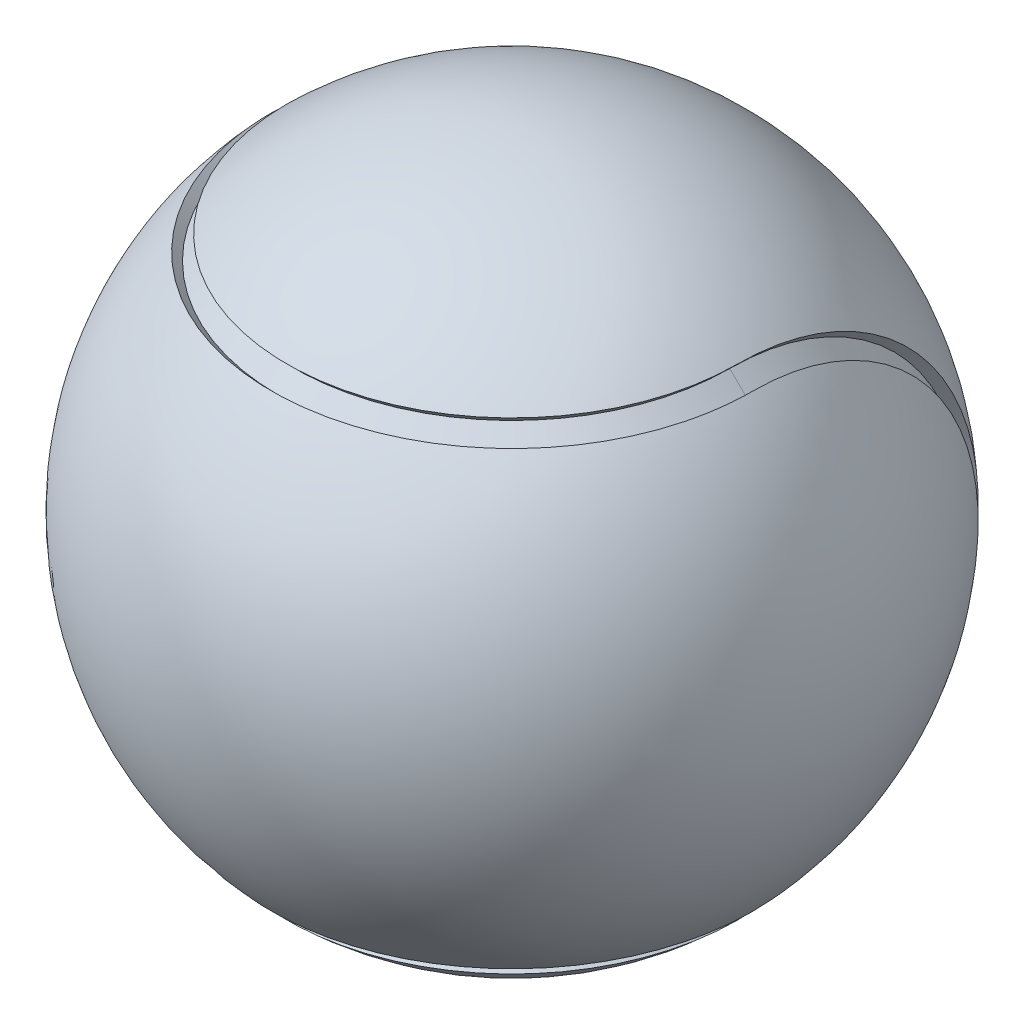
ISO-10303-21;
HEADER;
FILE_DESCRIPTION(('STEP AP214'),'2;1');
FILE_NAME('part.step','',(''),(''),'','','');
FILE_SCHEMA(('AUTOMOTIVE_DESIGN { 1 0 10303 214 1 1 1 1 }'));
ENDSEC;
DATA;
#1=APPLICATION_CONTEXT('core data for automotive mechanical design processes');
#2=APPLICATION_PROTOCOL_DEFINITION('international standard','automotive_design',2000,#1);
#3=PRODUCT_CONTEXT('',#1,'mechanical');
#4=PRODUCT('Part','Part','',(#3));
#5=PRODUCT_RELATED_PRODUCT_CATEGORY('part','',(#4));
#6=PRODUCT_DEFINITION_FORMATION('','',#4);
#7=PRODUCT_DEFINITION_CONTEXT('part definition',#1,'design');
#8=PRODUCT_DEFINITION('design','',#6,#7);
#9=PRODUCT_DEFINITION_SHAPE('','',#8);
#10=(LENGTH_UNIT() NAMED_UNIT(*) SI_UNIT(.MILLI.,.METRE.));
#11=(NAMED_UNIT(*) PLANE_ANGLE_UNIT() SI_UNIT($,.RADIAN.));
#12=(NAMED_UNIT(*) SI_UNIT($,.STERADIAN.) SOLID_ANGLE_UNIT());
#13=UNCERTAINTY_MEASURE_WITH_UNIT(LENGTH_MEASURE(1.E-05),#10,'distance_accuracy_value','');
#14=(GEOMETRIC_REPRESENTATION_CONTEXT(3) GLOBAL_UNCERTAINTY_ASSIGNED_CONTEXT((#13)) GLOBAL_UNIT_ASSIGNED_CONTEXT((#10,
#11,#12)) REPRESENTATION_CONTEXT('',''));
#15=CARTESIAN_POINT('',(0.,0.,0.));
#16=DIRECTION('',(0.,0.,1.));
#17=DIRECTION('',(1.,0.,0.));
#18=AXIS2_PLACEMENT_3D('',#15,#16,#17);
#19=CARTESIAN_POINT('',(0.,0.,0.));
#20=DIRECTION('',(-1.,0.,0.));
#21=DIRECTION('',(0.,1.,0.));
#22=AXIS2_PLACEMENT_3D('',#19,#20,#21);
#23=SPHERICAL_SURFACE('',#22,38.1);
#24=CARTESIAN_POINT('',(0.,26.0277714977281,0.));
#25=DIRECTION('',(0.,-1.,0.));
#26=DIRECTION('',(1.,0.,0.));
#27=AXIS2_PLACEMENT_3D('',#24,#25,#26);
#28=CIRCLE('',#27,27.8238227219419);
#29=CARTESIAN_POINT('',(-27.8238227219419,26.0277714977281,0.));
#30=VERTEX_POINT('',#29);
#31=CARTESIAN_POINT('',(27.8238227219419,26.0277714977281,-3.91992866779406E-13));
#32=VERTEX_POINT('',#31);
#33=EDGE_CURVE('E195',#30,#32,#28,.F.);
#34=ORIENTED_EDGE('',*,*,#33,.F.);
#35=CARTESIAN_POINT('',(-27.8238227219419,0.,0.));
#36=DIRECTION('',(1.,0.,0.));
#37=DIRECTION('',(0.,0.,-1.));
#38=AXIS2_PLACEMENT_3D('',#35,#36,#37);
#39=CIRCLE('',#38,26.0277714977282);
#40=CARTESIAN_POINT('',(-27.8238227219419,-26.0277714977283,-1.15067513016814E-12));
#41=VERTEX_POINT('',#40);
#42=EDGE_CURVE('E11',#30,#41,#39,.F.);
#43=ORIENTED_EDGE('',*,*,#42,.T.);
#44=CARTESIAN_POINT('',(0.,-26.0277714977283,0.));
#45=DIRECTION('',(0.,1.,0.));
#46=DIRECTION('',(-1.,0.,0.));
#47=AXIS2_PLACEMENT_3D('',#44,#45,#46);
#48=CIRCLE('',#47,27.8238227219419);
#49=CARTESIAN_POINT('',(27.8238227219419,-26.0277714977283,7.58682263388733E-13));
#50=VERTEX_POINT('',#49);
#51=EDGE_CURVE('E42',#41,#50,#48,.T.);
#52=ORIENTED_EDGE('',*,*,#51,.T.);
#53=CARTESIAN_POINT('',(27.8238227219419,0.,0.));
#54=DIRECTION('',(-1.,0.,0.));
#55=DIRECTION('',(0.,0.,1.));
#56=AXIS2_PLACEMENT_3D('',#53,#54,#55);
#57=CIRCLE('',#56,26.0277714977282);
#58=EDGE_CURVE('E203',#50,#32,#57,.F.);
#59=ORIENTED_EDGE('',*,*,#58,.T.);
#60=EDGE_LOOP('',(#34,#43,#52,#59));
#61=FACE_BOUND('',#60,.T.);
#62=ADVANCED_FACE('F33',(#61),#23,.T.);
#63=CARTESIAN_POINT('',(-25.1447171389936,0.,0.));
#64=DIRECTION('',(-1.,0.,0.));
#65=DIRECTION('',(0.,0.,1.));
#66=AXIS2_PLACEMENT_3D('',#63,#64,#65);
#67=CONICAL_SURFACE('',#66,26.9407683632076,0.785398163397447);
#68=DIRECTION('',(-0.707106781186548,-0.707106781186547,0.));
#69=VECTOR('',#68,1.);
#70=CARTESIAN_POINT('',(-26.9407683632074,-28.7368195874215,-1.16395962782366E-12));
#71=LINE('',#70,#69);
#72=CARTESIAN_POINT('',(-25.1447171389936,-26.9407683632077,-1.08804921731343E-12));
#73=VERTEX_POINT('',#72);
#74=CARTESIAN_POINT('',(-26.027771497728,-27.8238227219421,-1.12537165999806E-12));
#75=VERTEX_POINT('',#74);
#76=EDGE_CURVE('E139',#73,#75,#71,.T.);
#77=ORIENTED_EDGE('',*,*,#76,.F.);
#78=CARTESIAN_POINT('',(-25.1447171389936,0.,0.));
#79=DIRECTION('',(1.,0.,0.));
#80=DIRECTION('',(0.,0.,-1.));
#81=AXIS2_PLACEMENT_3D('',#78,#79,#80);
#82=CIRCLE('',#81,26.9407683632076);
#83=CARTESIAN_POINT('',(-25.1447171389936,26.9407683632075,0.));
#84=VERTEX_POINT('',#83);
#85=EDGE_CURVE('E119',#73,#84,#82,.T.);
#86=ORIENTED_EDGE('',*,*,#85,.T.);
#87=CARTESIAN_POINT('',(-25.1447171389936,26.9407683632075,1.08440110672005E-12));
#88=DIRECTION('',(-0.707106781186548,0.707106781186548,0.));
#89=VECTOR('',#88,1.);
#90=LINE('',#87,#89);
#91=CARTESIAN_POINT('',(-26.027771497728,27.8238227219419,5.56785116184242E-13));
#92=VERTEX_POINT('',#91);
#93=EDGE_CURVE('E123',#84,#92,#90,.T.);
#94=ORIENTED_EDGE('',*,*,#93,.T.);
#95=CARTESIAN_POINT('',(-26.027771497728,0.,0.));
#96=DIRECTION('',(1.,0.,0.));
#97=DIRECTION('',(0.,0.,-1.));
#98=AXIS2_PLACEMENT_3D('',#95,#96,#97);
#99=CIRCLE('',#98,27.823822721942);
#100=EDGE_CURVE('E189',#75,#92,#99,.T.);
#101=ORIENTED_EDGE('',*,*,#100,.F.);
#102=EDGE_LOOP('',(#77,#86,#94,#101));
#103=FACE_BOUND('',#102,.T.);
#104=ADVANCED_FACE('F137',(#103),#67,.F.);
#105=CARTESIAN_POINT('',(-28.7368195874213,0.,0.));
#106=DIRECTION('',(-1.,0.,0.));
#107=DIRECTION('',(0.,0.,1.));
#108=AXIS2_PLACEMENT_3D('',#105,#106,#107);
#109=CONICAL_SURFACE('',#108,26.9407683632076,0.78539816339745);
#110=CARTESIAN_POINT('',(-27.8238227219419,26.0277714977281,1.14590033673251E-12));
#111=DIRECTION('',(0.707106781186548,-0.707106781186548,0.));
#112=VECTOR('',#111,1.);
#113=LINE('',#110,#112);
#114=CARTESIAN_POINT('',(-26.9407683632074,25.1447171389936,1.11027334774753E-12));
#115=VERTEX_POINT('',#114);
#116=EDGE_CURVE('E49',#30,#115,#113,.T.);
#117=ORIENTED_EDGE('',*,*,#116,.T.);
#118=CARTESIAN_POINT('',(-26.9407683632074,0.,0.));
#119=DIRECTION('',(1.,0.,0.));
#120=DIRECTION('',(0.,0.,-1.));
#121=AXIS2_PLACEMENT_3D('',#118,#119,#120);
#122=CIRCLE('',#121,25.1447171389937);
#123=CARTESIAN_POINT('',(-26.9407683632074,-25.1447171389938,-1.1133526874835E-12));
#124=VERTEX_POINT('',#123);
#125=EDGE_CURVE('E122',#124,#115,#122,.T.);
#126=ORIENTED_EDGE('',*,*,#125,.F.);
#127=DIRECTION('',(0.707106781186546,0.707106781186549,0.));
#128=VECTOR('',#127,1.);
#129=CARTESIAN_POINT('',(-28.7368195874213,-26.9407683632077,-1.18926309799374E-12));
#130=LINE('',#129,#128);
#131=EDGE_CURVE('E214',#41,#124,#130,.T.);
#132=ORIENTED_EDGE('',*,*,#131,.F.);
#133=ORIENTED_EDGE('',*,*,#42,.F.);
#134=EDGE_LOOP('',(#117,#126,#132,#133));
#135=FACE_BOUND('',#134,.T.);
#136=ADVANCED_FACE('F161',(#135),#109,.T.);
#137=CARTESIAN_POINT('',(0.,-26.9407683632077,0.));
#138=DIRECTION('',(0.,-1.,0.));
#139=DIRECTION('',(1.,0.,0.));
#140=AXIS2_PLACEMENT_3D('',#137,#138,#139);
#141=CONICAL_SURFACE('',#140,25.1447171389936,0.785398163397449);
#142=DIRECTION('',(0.707106781186548,-0.707106781186547,0.));
#143=VECTOR('',#142,1.);
#144=CARTESIAN_POINT('',(26.9407683632074,-28.7368195874215,7.8440757527247E-13));
#145=LINE('',#144,#143);
#146=CARTESIAN_POINT('',(25.1447171389936,-26.9407683632076,7.33800634932311E-13));
#147=VERTEX_POINT('',#146);
#148=CARTESIAN_POINT('',(26.027771497728,-27.8238227219421,7.58682263388733E-13));
#149=VERTEX_POINT('',#148);
#150=EDGE_CURVE('E285',#147,#149,#145,.T.);
#151=ORIENTED_EDGE('',*,*,#150,.F.);
#152=CARTESIAN_POINT('',(0.,-26.9407683632077,0.));
#153=DIRECTION('',(0.,-1.,0.));
#154=DIRECTION('',(1.,0.,0.));
#155=AXIS2_PLACEMENT_3D('',#152,#153,#154);
#156=CIRCLE('',#155,25.1447171389936);
#157=EDGE_CURVE('E226',#147,#73,#156,.T.);
#158=ORIENTED_EDGE('',*,*,#157,.T.);
#159=ORIENTED_EDGE('',*,*,#76,.T.);
#160=CARTESIAN_POINT('',(0.,-27.8238227219421,0.));
#161=DIRECTION('',(0.,1.,0.));
#162=DIRECTION('',(-1.,0.,0.));
#163=AXIS2_PLACEMENT_3D('',#160,#161,#162);
#164=CIRCLE('',#163,26.027771497728);
#165=EDGE_CURVE('E188',#149,#75,#164,.F.);
#166=ORIENTED_EDGE('',*,*,#165,.F.);
#167=EDGE_LOOP('',(#151,#158,#159,#166));
#168=FACE_BOUND('',#167,.T.);
#169=ADVANCED_FACE('F280',(#168),#141,.T.);
#170=CARTESIAN_POINT('',(0.,-26.9407683632077,0.));
#171=DIRECTION('',(0.,-1.,0.));
#172=DIRECTION('',(1.,0.,0.));
#173=AXIS2_PLACEMENT_3D('',#170,#171,#172);
#174=CONICAL_SURFACE('',#173,28.7368195874213,0.785398163397446);
#175=ORIENTED_EDGE('',*,*,#131,.T.);
#176=CARTESIAN_POINT('',(0.,-25.1447171389938,0.));
#177=DIRECTION('',(0.,-1.,0.));
#178=DIRECTION('',(1.,0.,0.));
#179=AXIS2_PLACEMENT_3D('',#176,#177,#178);
#180=CIRCLE('',#179,26.9407683632074);
#181=CARTESIAN_POINT('',(26.9407683632075,-25.1447171389938,7.33800634932311E-13));
#182=VERTEX_POINT('',#181);
#183=EDGE_CURVE('E228',#182,#124,#180,.T.);
#184=ORIENTED_EDGE('',*,*,#183,.F.);
#185=DIRECTION('',(-0.707106781186546,0.707106781186549,0.));
#186=VECTOR('',#185,1.);
#187=CARTESIAN_POINT('',(28.7368195874213,-26.9407683632076,7.8440757527247E-13));
#188=LINE('',#187,#186);
#189=EDGE_CURVE('E111',#50,#182,#188,.T.);
#190=ORIENTED_EDGE('',*,*,#189,.F.);
#191=ORIENTED_EDGE('',*,*,#51,.F.);
#192=EDGE_LOOP('',(#175,#184,#190,#191));
#193=FACE_BOUND('',#192,.T.);
#194=ADVANCED_FACE('F212',(#193),#174,.F.);
#195=CARTESIAN_POINT('',(25.1447171389936,0.,0.));
#196=DIRECTION('',(1.,0.,0.));
#197=DIRECTION('',(0.,0.,-1.));
#198=AXIS2_PLACEMENT_3D('',#195,#196,#197);
#199=CONICAL_SURFACE('',#198,26.9407683632076,0.785398163397447);
#200=DIRECTION('',(0.707106781186548,0.707106781186547,0.));
#201=VECTOR('',#200,1.);
#202=CARTESIAN_POINT('',(26.9407683632074,28.7368195874213,-3.79552052551194E-13));
#203=LINE('',#202,#201);
#204=CARTESIAN_POINT('',(25.1447171389936,26.9407683632075,-3.54248582381115E-13));
#205=VERTEX_POINT('',#204);
#206=CARTESIAN_POINT('',(26.0277714977281,27.8238227219419,-3.66689396609326E-13));
#207=VERTEX_POINT('',#206);
#208=EDGE_CURVE('E58',#205,#207,#203,.T.);
#209=ORIENTED_EDGE('',*,*,#208,.F.);
#210=CARTESIAN_POINT('',(25.1447171389936,0.,0.));
#211=DIRECTION('',(-1.,0.,0.));
#212=DIRECTION('',(0.,0.,1.));
#213=AXIS2_PLACEMENT_3D('',#210,#211,#212);
#214=CIRCLE('',#213,26.9407683632076);
#215=EDGE_CURVE('E221',#205,#147,#214,.T.);
#216=ORIENTED_EDGE('',*,*,#215,.T.);
#217=ORIENTED_EDGE('',*,*,#150,.T.);
#218=CARTESIAN_POINT('',(26.027771497728,0.,0.));
#219=DIRECTION('',(-1.,0.,0.));
#220=DIRECTION('',(0.,0.,1.));
#221=AXIS2_PLACEMENT_3D('',#218,#219,#220);
#222=CIRCLE('',#221,27.823822721942);
#223=EDGE_CURVE('E190',#207,#149,#222,.T.);
#224=ORIENTED_EDGE('',*,*,#223,.F.);
#225=EDGE_LOOP('',(#209,#216,#217,#224));
#226=FACE_BOUND('',#225,.T.);
#227=ADVANCED_FACE('F270',(#226),#199,.F.);
#228=CARTESIAN_POINT('',(28.7368195874213,0.,0.));
#229=DIRECTION('',(1.,0.,0.));
#230=DIRECTION('',(0.,0.,-1.));
#231=AXIS2_PLACEMENT_3D('',#228,#229,#230);
#232=CONICAL_SURFACE('',#231,26.9407683632076,0.78539816339745);
#233=ORIENTED_EDGE('',*,*,#189,.T.);
#234=CARTESIAN_POINT('',(26.9407683632075,0.,0.));
#235=DIRECTION('',(-1.,0.,0.));
#236=DIRECTION('',(0.,0.,1.));
#237=AXIS2_PLACEMENT_3D('',#234,#235,#236);
#238=CIRCLE('',#237,25.1447171389937);
#239=CARTESIAN_POINT('',(26.9407683632075,25.1447171389936,-3.79552052551194E-13));
#240=VERTEX_POINT('',#239);
#241=EDGE_CURVE('E216',#240,#182,#238,.T.);
#242=ORIENTED_EDGE('',*,*,#241,.F.);
#243=DIRECTION('',(-0.707106781186546,-0.707106781186549,0.));
#244=VECTOR('',#243,1.);
#245=CARTESIAN_POINT('',(28.7368195874213,26.9407683632075,-4.04855522721274E-13));
#246=LINE('',#245,#244);
#247=EDGE_CURVE('E295',#32,#240,#246,.T.);
#248=ORIENTED_EDGE('',*,*,#247,.F.);
#249=ORIENTED_EDGE('',*,*,#58,.F.);
#250=EDGE_LOOP('',(#233,#242,#248,#249));
#251=FACE_BOUND('',#250,.T.);
#252=ADVANCED_FACE('F256',(#251),#232,.T.);
#253=CARTESIAN_POINT('',(0.,26.9407683632075,0.));
#254=DIRECTION('',(0.,1.,0.));
#255=DIRECTION('',(-1.,0.,0.));
#256=AXIS2_PLACEMENT_3D('',#253,#254,#255);
#257=CONICAL_SURFACE('',#256,28.7368195874213,0.785398163397446);
#258=ORIENTED_EDGE('',*,*,#33,.T.);
#259=ORIENTED_EDGE('',*,*,#247,.T.);
#260=CARTESIAN_POINT('',(0.,25.1447171389936,0.));
#261=DIRECTION('',(0.,-1.,0.));
#262=DIRECTION('',(1.,0.,0.));
#263=AXIS2_PLACEMENT_3D('',#260,#261,#262);
#264=CIRCLE('',#263,26.9407683632075);
#265=EDGE_CURVE('E112',#240,#115,#264,.T.);
#266=ORIENTED_EDGE('',*,*,#265,.T.);
#267=ORIENTED_EDGE('',*,*,#116,.F.);
#268=EDGE_LOOP('',(#258,#259,#266,#267));
#269=FACE_BOUND('',#268,.T.);
#270=ADVANCED_FACE('F173',(#269),#257,.F.);
#271=CARTESIAN_POINT('',(0.,26.9407683632075,0.));
#272=DIRECTION('',(0.,1.,0.));
#273=DIRECTION('',(-1.,0.,0.));
#274=AXIS2_PLACEMENT_3D('',#271,#272,#273);
#275=CONICAL_SURFACE('',#274,25.1447171389936,0.785398163397449);
#276=CARTESIAN_POINT('',(0.,27.8238227219419,0.));
#277=DIRECTION('',(0.,-1.,0.));
#278=DIRECTION('',(1.,0.,0.));
#279=AXIS2_PLACEMENT_3D('',#276,#277,#278);
#280=CIRCLE('',#279,26.0277714977281);
#281=EDGE_CURVE('E130',#207,#92,#280,.T.);
#282=ORIENTED_EDGE('',*,*,#281,.T.);
#283=ORIENTED_EDGE('',*,*,#93,.F.);
#284=CARTESIAN_POINT('',(0.,26.9407683632075,0.));
#285=DIRECTION('',(0.,-1.,0.));
#286=DIRECTION('',(1.,0.,0.));
#287=AXIS2_PLACEMENT_3D('',#284,#285,#286);
#288=CIRCLE('',#287,25.1447171389936);
#289=EDGE_CURVE('E101',#205,#84,#288,.T.);
#290=ORIENTED_EDGE('',*,*,#289,.F.);
#291=ORIENTED_EDGE('',*,*,#208,.T.);
#292=EDGE_LOOP('',(#282,#283,#290,#291));
#293=FACE_BOUND('',#292,.T.);
#294=ADVANCED_FACE('F128',(#293),#275,.T.);
#295=CARTESIAN_POINT('',(-26.9407683632074,0.,0.));
#296=DIRECTION('',(1.,0.,0.));
#297=DIRECTION('',(0.,0.,-1.));
#298=AXIS2_PLACEMENT_3D('',#295,#296,#297);
#299=CONICAL_SURFACE('',#298,25.1447171389937,0.785398163397447);
#300=DIRECTION('',(0.707106781186549,-0.707106781186546,0.));
#301=VECTOR('',#300,1.);
#302=CARTESIAN_POINT('',(-25.1447171389936,-26.9407683632077,-1.08804921731343E-12));
#303=LINE('',#302,#301);
#304=EDGE_CURVE('E218',#124,#73,#303,.T.);
#305=ORIENTED_EDGE('',*,*,#304,.F.);
#306=ORIENTED_EDGE('',*,*,#125,.T.);
#307=CARTESIAN_POINT('',(-26.9407683632074,25.1447171389936,1.05927759891712E-12));
#308=DIRECTION('',(0.707106781186548,0.707106781186547,0.));
#309=VECTOR('',#308,1.);
#310=LINE('',#307,#309);
#311=EDGE_CURVE('E105',#115,#84,#310,.T.);
#312=ORIENTED_EDGE('',*,*,#311,.T.);
#313=ORIENTED_EDGE('',*,*,#85,.F.);
#314=EDGE_LOOP('',(#305,#306,#312,#313));
#315=FACE_BOUND('',#314,.T.);
#316=ADVANCED_FACE('F117',(#315),#299,.T.);
#317=CARTESIAN_POINT('',(0.,-25.1447171389938,0.));
#318=DIRECTION('',(0.,1.,0.));
#319=DIRECTION('',(-1.,0.,0.));
#320=AXIS2_PLACEMENT_3D('',#317,#318,#319);
#321=CONICAL_SURFACE('',#320,26.9407683632074,0.785398163397449);
#322=DIRECTION('',(-0.707106781186548,-0.707106781186547,0.));
#323=VECTOR('',#322,1.);
#324=CARTESIAN_POINT('',(25.1447171389936,-26.9407683632076,7.33800634932311E-13));
#325=LINE('',#324,#323);
#326=EDGE_CURVE('E287',#182,#147,#325,.T.);
#327=ORIENTED_EDGE('',*,*,#326,.F.);
#328=ORIENTED_EDGE('',*,*,#183,.T.);
#329=ORIENTED_EDGE('',*,*,#304,.T.);
#330=ORIENTED_EDGE('',*,*,#157,.F.);
#331=EDGE_LOOP('',(#327,#328,#329,#330));
#332=FACE_BOUND('',#331,.T.);
#333=ADVANCED_FACE('F166',(#332),#321,.T.);
#334=CARTESIAN_POINT('',(26.9407683632075,0.,0.));
#335=DIRECTION('',(-1.,0.,0.));
#336=DIRECTION('',(0.,0.,1.));
#337=AXIS2_PLACEMENT_3D('',#334,#335,#336);
#338=CONICAL_SURFACE('',#337,25.1447171389937,0.785398163397447);
#339=DIRECTION('',(-0.707106781186548,0.707106781186547,0.));
#340=VECTOR('',#339,1.);
#341=CARTESIAN_POINT('',(25.1447171389936,26.9407683632075,-3.54248582381115E-13));
#342=LINE('',#341,#340);
#343=EDGE_CURVE('E109',#240,#205,#342,.T.);
#344=ORIENTED_EDGE('',*,*,#343,.F.);
#345=ORIENTED_EDGE('',*,*,#241,.T.);
#346=ORIENTED_EDGE('',*,*,#326,.T.);
#347=ORIENTED_EDGE('',*,*,#215,.F.);
#348=EDGE_LOOP('',(#344,#345,#346,#347));
#349=FACE_BOUND('',#348,.T.);
#350=ADVANCED_FACE('F171',(#349),#338,.T.);
#351=CARTESIAN_POINT('',(0.,25.1447171389936,0.));
#352=DIRECTION('',(0.,-1.,0.));
#353=DIRECTION('',(1.,0.,0.));
#354=AXIS2_PLACEMENT_3D('',#351,#352,#353);
#355=CONICAL_SURFACE('',#354,26.9407683632075,0.785398163397449);
#356=ORIENTED_EDGE('',*,*,#343,.T.);
#357=ORIENTED_EDGE('',*,*,#289,.T.);
#358=ORIENTED_EDGE('',*,*,#311,.F.);
#359=ORIENTED_EDGE('',*,*,#265,.F.);
#360=EDGE_LOOP('',(#356,#357,#358,#359));
#361=FACE_BOUND('',#360,.T.);
#362=ADVANCED_FACE('F103',(#361),#355,.T.);
#363=ORIENTED_EDGE('',*,*,#165,.T.);
#364=ORIENTED_EDGE('',*,*,#100,.T.);
#365=ORIENTED_EDGE('',*,*,#281,.F.);
#366=ORIENTED_EDGE('',*,*,#223,.T.);
#367=EDGE_LOOP('',(#363,#364,#365,#366));
#368=FACE_BOUND('',#367,.T.);
#369=ADVANCED_FACE('F35',(#368),#23,.T.);
#370=CLOSED_SHELL('',(#62,#104,#136,#169,#194,#227,#252,#270,#294,#316,#333,#350,#362,#369));
#371=MANIFOLD_SOLID_BREP('B2',#370);
#372=ADVANCED_BREP_SHAPE_REPRESENTATION('',(#18,#371),#14);
#373=SHAPE_DEFINITION_REPRESENTATION(#9,#372);
ENDSEC;
END-ISO-10303-21;
